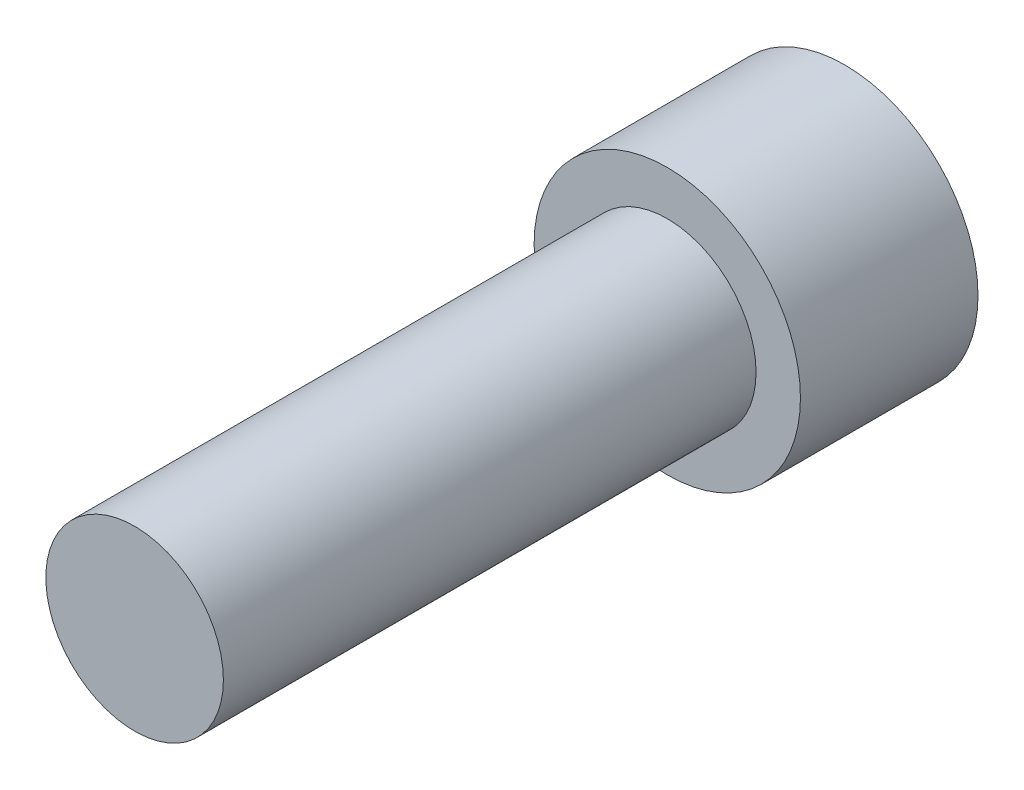
ISO-10303-21;
HEADER;
FILE_DESCRIPTION(('STEP AP214'),'2;1');
FILE_NAME('part.step','',(''),(''),'','','');
FILE_SCHEMA(('AUTOMOTIVE_DESIGN { 1 0 10303 214 1 1 1 1 }'));
ENDSEC;
DATA;
#1=APPLICATION_CONTEXT('core data for automotive mechanical design processes');
#2=APPLICATION_PROTOCOL_DEFINITION('international standard','automotive_design',2000,#1);
#3=PRODUCT_CONTEXT('',#1,'mechanical');
#4=PRODUCT('Part','Part','',(#3));
#5=PRODUCT_RELATED_PRODUCT_CATEGORY('part','',(#4));
#6=PRODUCT_DEFINITION_FORMATION('','',#4);
#7=PRODUCT_DEFINITION_CONTEXT('part definition',#1,'design');
#8=PRODUCT_DEFINITION('design','',#6,#7);
#9=PRODUCT_DEFINITION_SHAPE('','',#8);
#10=(LENGTH_UNIT() NAMED_UNIT(*) SI_UNIT(.MILLI.,.METRE.));
#11=(NAMED_UNIT(*) PLANE_ANGLE_UNIT() SI_UNIT($,.RADIAN.));
#12=(NAMED_UNIT(*) SI_UNIT($,.STERADIAN.) SOLID_ANGLE_UNIT());
#13=UNCERTAINTY_MEASURE_WITH_UNIT(LENGTH_MEASURE(1.E-05),#10,'distance_accuracy_value','');
#14=(GEOMETRIC_REPRESENTATION_CONTEXT(3) GLOBAL_UNCERTAINTY_ASSIGNED_CONTEXT((#13)) GLOBAL_UNIT_ASSIGNED_CONTEXT((#10,
#11,#12)) REPRESENTATION_CONTEXT('',''));
#15=CARTESIAN_POINT('',(0.,0.,0.));
#16=DIRECTION('',(0.,0.,1.));
#17=DIRECTION('',(1.,0.,0.));
#18=AXIS2_PLACEMENT_3D('',#15,#16,#17);
#19=CARTESIAN_POINT('',(0.,0.,1.));
#20=DIRECTION('',(0.,0.,1.));
#21=DIRECTION('',(1.,0.,0.));
#22=AXIS2_PLACEMENT_3D('',#19,#20,#21);
#23=PLANE('',#22);
#24=CARTESIAN_POINT('',(0.,0.,1.));
#25=DIRECTION('',(0.,0.,1.));
#26=DIRECTION('',(1.,0.,0.));
#27=AXIS2_PLACEMENT_3D('',#24,#25,#26);
#28=CIRCLE('',#27,0.750000000000001);
#29=CARTESIAN_POINT('',(0.750000000000001,0.,1.));
#30=VERTEX_POINT('',#29);
#31=EDGE_CURVE('E11',#30,#30,#28,.T.);
#32=ORIENTED_EDGE('',*,*,#31,.T.);
#33=EDGE_LOOP('',(#32));
#34=FACE_BOUND('',#33,.T.);
#35=CARTESIAN_POINT('',(0.,0.,1.));
#36=DIRECTION('',(0.,0.,1.));
#37=DIRECTION('',(1.,0.,0.));
#38=AXIS2_PLACEMENT_3D('',#35,#36,#37);
#39=CIRCLE('',#38,0.5);
#40=CARTESIAN_POINT('',(0.5,0.,1.));
#41=VERTEX_POINT('',#40);
#42=EDGE_CURVE('E134',#41,#41,#39,.T.);
#43=ORIENTED_EDGE('',*,*,#42,.F.);
#44=EDGE_LOOP('',(#43));
#45=FACE_BOUND('',#44,.T.);
#46=ADVANCED_FACE('F32',(#34,#45),#23,.T.);
#47=CARTESIAN_POINT('',(0.,0.,1.));
#48=DIRECTION('',(0.,0.,-1.));
#49=DIRECTION('',(-1.,0.,0.));
#50=AXIS2_PLACEMENT_3D('',#47,#48,#49);
#51=CYLINDRICAL_SURFACE('',#50,0.750000000000001);
#52=ORIENTED_EDGE('',*,*,#31,.F.);
#53=EDGE_LOOP('',(#52));
#54=FACE_BOUND('',#53,.T.);
#55=CARTESIAN_POINT('',(0.,0.,0.));
#56=DIRECTION('',(0.,0.,1.));
#57=DIRECTION('',(1.,0.,0.));
#58=AXIS2_PLACEMENT_3D('',#55,#56,#57);
#59=CIRCLE('',#58,0.750000000000001);
#60=CARTESIAN_POINT('',(0.750000000000001,0.,0.));
#61=VERTEX_POINT('',#60);
#62=EDGE_CURVE('E36',#61,#61,#59,.T.);
#63=ORIENTED_EDGE('',*,*,#62,.T.);
#64=EDGE_LOOP('',(#63));
#65=FACE_BOUND('',#64,.T.);
#66=ADVANCED_FACE('F34',(#54,#65),#51,.T.);
#67=CARTESIAN_POINT('',(0.,0.,0.));
#68=DIRECTION('',(0.,0.,1.));
#69=DIRECTION('',(1.,0.,0.));
#70=AXIS2_PLACEMENT_3D('',#67,#68,#69);
#71=PLANE('',#70);
#72=DIRECTION('',(0.5,0.866025403784439,0.));
#73=VECTOR('',#72,1.);
#74=CARTESIAN_POINT('',(-0.577350269189626,0.,0.));
#75=LINE('',#74,#73);
#76=CARTESIAN_POINT('',(-0.577350269189626,0.,0.));
#77=VERTEX_POINT('',#76);
#78=CARTESIAN_POINT('',(-0.288675134594813,0.5,0.));
#79=VERTEX_POINT('',#78);
#80=EDGE_CURVE('E121',#77,#79,#75,.T.);
#81=ORIENTED_EDGE('',*,*,#80,.F.);
#82=DIRECTION('',(-0.5,0.866025403784439,0.));
#83=VECTOR('',#82,1.);
#84=CARTESIAN_POINT('',(-0.288675134594813,-0.5,0.));
#85=LINE('',#84,#83);
#86=CARTESIAN_POINT('',(-0.288675134594813,-0.5,0.));
#87=VERTEX_POINT('',#86);
#88=EDGE_CURVE('E47',#87,#77,#85,.T.);
#89=ORIENTED_EDGE('',*,*,#88,.F.);
#90=DIRECTION('',(-1.,0.,0.));
#91=VECTOR('',#90,1.);
#92=CARTESIAN_POINT('',(0.288675134594813,-0.5,0.));
#93=LINE('',#92,#91);
#94=CARTESIAN_POINT('',(0.288675134594813,-0.5,0.));
#95=VERTEX_POINT('',#94);
#96=EDGE_CURVE('E130',#95,#87,#93,.T.);
#97=ORIENTED_EDGE('',*,*,#96,.F.);
#98=DIRECTION('',(-0.5,-0.866025403784439,0.));
#99=VECTOR('',#98,1.);
#100=CARTESIAN_POINT('',(0.577350269189626,0.,0.));
#101=LINE('',#100,#99);
#102=CARTESIAN_POINT('',(0.577350269189626,0.,0.));
#103=VERTEX_POINT('',#102);
#104=EDGE_CURVE('E128',#103,#95,#101,.T.);
#105=ORIENTED_EDGE('',*,*,#104,.F.);
#106=DIRECTION('',(0.5,-0.866025403784439,0.));
#107=VECTOR('',#106,1.);
#108=CARTESIAN_POINT('',(0.288675134594813,0.5,0.));
#109=LINE('',#108,#107);
#110=CARTESIAN_POINT('',(0.288675134594813,0.5,0.));
#111=VERTEX_POINT('',#110);
#112=EDGE_CURVE('E95',#111,#103,#109,.T.);
#113=ORIENTED_EDGE('',*,*,#112,.F.);
#114=DIRECTION('',(1.,0.,0.));
#115=VECTOR('',#114,1.);
#116=CARTESIAN_POINT('',(-0.288675134594813,0.5,0.));
#117=LINE('',#116,#115);
#118=EDGE_CURVE('E124',#79,#111,#117,.T.);
#119=ORIENTED_EDGE('',*,*,#118,.F.);
#120=EDGE_LOOP('',(#81,#89,#97,#105,#113,#119));
#121=FACE_BOUND('',#120,.T.);
#122=ORIENTED_EDGE('',*,*,#62,.F.);
#123=EDGE_LOOP('',(#122));
#124=FACE_BOUND('',#123,.T.);
#125=ADVANCED_FACE('F154',(#121,#124),#71,.F.);
#126=CARTESIAN_POINT('',(0.,0.,4.));
#127=DIRECTION('',(0.,0.,-1.));
#128=DIRECTION('',(-1.,0.,0.));
#129=AXIS2_PLACEMENT_3D('',#126,#127,#128);
#130=CYLINDRICAL_SURFACE('',#129,0.5);
#131=CARTESIAN_POINT('',(0.,0.,4.));
#132=DIRECTION('',(0.,0.,1.));
#133=DIRECTION('',(1.,0.,0.));
#134=AXIS2_PLACEMENT_3D('',#131,#132,#133);
#135=CIRCLE('',#134,0.5);
#136=CARTESIAN_POINT('',(0.5,0.,4.));
#137=VERTEX_POINT('',#136);
#138=EDGE_CURVE('E140',#137,#137,#135,.T.);
#139=ORIENTED_EDGE('',*,*,#138,.F.);
#140=EDGE_LOOP('',(#139));
#141=FACE_BOUND('',#140,.T.);
#142=ORIENTED_EDGE('',*,*,#42,.T.);
#143=EDGE_LOOP('',(#142));
#144=FACE_BOUND('',#143,.T.);
#145=ADVANCED_FACE('F146',(#141,#144),#130,.T.);
#146=CARTESIAN_POINT('',(0.,0.,4.));
#147=DIRECTION('',(0.,0.,1.));
#148=DIRECTION('',(1.,0.,0.));
#149=AXIS2_PLACEMENT_3D('',#146,#147,#148);
#150=PLANE('',#149);
#151=ORIENTED_EDGE('',*,*,#138,.T.);
#152=EDGE_LOOP('',(#151));
#153=FACE_BOUND('',#152,.T.);
#154=ADVANCED_FACE('F163',(#153),#150,.T.);
#155=CARTESIAN_POINT('',(-0.288675134594813,-0.5,0.75));
#156=DIRECTION('',(-0.866025403784439,-0.5,0.));
#157=DIRECTION('',(0.5,-0.866025403784439,0.));
#158=AXIS2_PLACEMENT_3D('',#155,#156,#157);
#159=PLANE('',#158);
#160=ORIENTED_EDGE('',*,*,#88,.T.);
#161=DIRECTION('',(0.,0.,-1.));
#162=VECTOR('',#161,1.);
#163=CARTESIAN_POINT('',(-0.577350269189626,0.,0.75));
#164=LINE('',#163,#162);
#165=CARTESIAN_POINT('',(-0.577350269189626,0.,0.75));
#166=VERTEX_POINT('',#165);
#167=EDGE_CURVE('E77',#166,#77,#164,.T.);
#168=ORIENTED_EDGE('',*,*,#167,.F.);
#169=DIRECTION('',(-0.5,0.866025403784439,0.));
#170=VECTOR('',#169,1.);
#171=CARTESIAN_POINT('',(-0.288675134594813,-0.5,0.75));
#172=LINE('',#171,#170);
#173=CARTESIAN_POINT('',(-0.288675134594813,-0.5,0.75));
#174=VERTEX_POINT('',#173);
#175=EDGE_CURVE('E132',#174,#166,#172,.T.);
#176=ORIENTED_EDGE('',*,*,#175,.F.);
#177=DIRECTION('',(0.,0.,-1.));
#178=VECTOR('',#177,1.);
#179=CARTESIAN_POINT('',(-0.288675134594813,-0.5,0.75));
#180=LINE('',#179,#178);
#181=EDGE_CURVE('E55',#174,#87,#180,.T.);
#182=ORIENTED_EDGE('',*,*,#181,.T.);
#183=EDGE_LOOP('',(#160,#168,#176,#182));
#184=FACE_BOUND('',#183,.T.);
#185=ADVANCED_FACE('F175',(#184),#159,.F.);
#186=CARTESIAN_POINT('',(0.288675134594813,-0.5,0.75));
#187=DIRECTION('',(0.,-1.,0.));
#188=DIRECTION('',(1.,0.,0.));
#189=AXIS2_PLACEMENT_3D('',#186,#187,#188);
#190=PLANE('',#189);
#191=ORIENTED_EDGE('',*,*,#96,.T.);
#192=ORIENTED_EDGE('',*,*,#181,.F.);
#193=DIRECTION('',(-1.,0.,0.));
#194=VECTOR('',#193,1.);
#195=CARTESIAN_POINT('',(0.288675134594813,-0.5,0.75));
#196=LINE('',#195,#194);
#197=CARTESIAN_POINT('',(0.288675134594813,-0.5,0.75));
#198=VERTEX_POINT('',#197);
#199=EDGE_CURVE('E107',#198,#174,#196,.T.);
#200=ORIENTED_EDGE('',*,*,#199,.F.);
#201=DIRECTION('',(0.,0.,-1.));
#202=VECTOR('',#201,1.);
#203=CARTESIAN_POINT('',(0.288675134594813,-0.5,0.75));
#204=LINE('',#203,#202);
#205=EDGE_CURVE('E99',#198,#95,#204,.T.);
#206=ORIENTED_EDGE('',*,*,#205,.T.);
#207=EDGE_LOOP('',(#191,#192,#200,#206));
#208=FACE_BOUND('',#207,.T.);
#209=ADVANCED_FACE('F177',(#208),#190,.F.);
#210=CARTESIAN_POINT('',(0.577350269189626,0.,0.75));
#211=DIRECTION('',(0.866025403784439,-0.5,0.));
#212=DIRECTION('',(0.5,0.866025403784439,0.));
#213=AXIS2_PLACEMENT_3D('',#210,#211,#212);
#214=PLANE('',#213);
#215=ORIENTED_EDGE('',*,*,#104,.T.);
#216=ORIENTED_EDGE('',*,*,#205,.F.);
#217=DIRECTION('',(-0.5,-0.866025403784439,0.));
#218=VECTOR('',#217,1.);
#219=CARTESIAN_POINT('',(0.577350269189626,0.,0.75));
#220=LINE('',#219,#218);
#221=CARTESIAN_POINT('',(0.577350269189626,0.,0.75));
#222=VERTEX_POINT('',#221);
#223=EDGE_CURVE('E103',#222,#198,#220,.T.);
#224=ORIENTED_EDGE('',*,*,#223,.F.);
#225=DIRECTION('',(0.,0.,-1.));
#226=VECTOR('',#225,1.);
#227=CARTESIAN_POINT('',(0.577350269189626,0.,0.75));
#228=LINE('',#227,#226);
#229=EDGE_CURVE('E88',#222,#103,#228,.T.);
#230=ORIENTED_EDGE('',*,*,#229,.T.);
#231=EDGE_LOOP('',(#215,#216,#224,#230));
#232=FACE_BOUND('',#231,.T.);
#233=ADVANCED_FACE('F104',(#232),#214,.F.);
#234=CARTESIAN_POINT('',(0.288675134594813,0.5,0.75));
#235=DIRECTION('',(0.866025403784439,0.5,0.));
#236=DIRECTION('',(-0.5,0.866025403784439,0.));
#237=AXIS2_PLACEMENT_3D('',#234,#235,#236);
#238=PLANE('',#237);
#239=ORIENTED_EDGE('',*,*,#112,.T.);
#240=ORIENTED_EDGE('',*,*,#229,.F.);
#241=DIRECTION('',(0.5,-0.866025403784439,0.));
#242=VECTOR('',#241,1.);
#243=CARTESIAN_POINT('',(0.288675134594813,0.5,0.75));
#244=LINE('',#243,#242);
#245=CARTESIAN_POINT('',(0.288675134594813,0.5,0.75));
#246=VERTEX_POINT('',#245);
#247=EDGE_CURVE('E92',#246,#222,#244,.T.);
#248=ORIENTED_EDGE('',*,*,#247,.F.);
#249=DIRECTION('',(0.,0.,-1.));
#250=VECTOR('',#249,1.);
#251=CARTESIAN_POINT('',(0.288675134594813,0.5,0.75));
#252=LINE('',#251,#250);
#253=EDGE_CURVE('E100',#246,#111,#252,.T.);
#254=ORIENTED_EDGE('',*,*,#253,.T.);
#255=EDGE_LOOP('',(#239,#240,#248,#254));
#256=FACE_BOUND('',#255,.T.);
#257=ADVANCED_FACE('F90',(#256),#238,.F.);
#258=CARTESIAN_POINT('',(-0.288675134594813,0.5,0.75));
#259=DIRECTION('',(0.,1.,0.));
#260=DIRECTION('',(0.,0.,1.));
#261=AXIS2_PLACEMENT_3D('',#258,#259,#260);
#262=PLANE('',#261);
#263=ORIENTED_EDGE('',*,*,#118,.T.);
#264=ORIENTED_EDGE('',*,*,#253,.F.);
#265=DIRECTION('',(1.,0.,0.));
#266=VECTOR('',#265,1.);
#267=CARTESIAN_POINT('',(-0.288675134594813,0.5,0.75));
#268=LINE('',#267,#266);
#269=CARTESIAN_POINT('',(-0.288675134594813,0.5,0.75));
#270=VERTEX_POINT('',#269);
#271=EDGE_CURVE('E113',#270,#246,#268,.T.);
#272=ORIENTED_EDGE('',*,*,#271,.F.);
#273=DIRECTION('',(0.,0.,-1.));
#274=VECTOR('',#273,1.);
#275=CARTESIAN_POINT('',(-0.288675134594813,0.5,0.75));
#276=LINE('',#275,#274);
#277=EDGE_CURVE('E137',#270,#79,#276,.T.);
#278=ORIENTED_EDGE('',*,*,#277,.T.);
#279=EDGE_LOOP('',(#263,#264,#272,#278));
#280=FACE_BOUND('',#279,.T.);
#281=ADVANCED_FACE('F188',(#280),#262,.F.);
#282=CARTESIAN_POINT('',(-0.577350269189626,0.,0.75));
#283=DIRECTION('',(-0.866025403784439,0.5,0.));
#284=DIRECTION('',(-0.5,-0.866025403784439,0.));
#285=AXIS2_PLACEMENT_3D('',#282,#283,#284);
#286=PLANE('',#285);
#287=ORIENTED_EDGE('',*,*,#80,.T.);
#288=ORIENTED_EDGE('',*,*,#277,.F.);
#289=DIRECTION('',(0.5,0.866025403784439,0.));
#290=VECTOR('',#289,1.);
#291=CARTESIAN_POINT('',(-0.577350269189626,0.,0.75));
#292=LINE('',#291,#290);
#293=EDGE_CURVE('E115',#166,#270,#292,.T.);
#294=ORIENTED_EDGE('',*,*,#293,.F.);
#295=ORIENTED_EDGE('',*,*,#167,.T.);
#296=EDGE_LOOP('',(#287,#288,#294,#295));
#297=FACE_BOUND('',#296,.T.);
#298=ADVANCED_FACE('F173',(#297),#286,.F.);
#299=CARTESIAN_POINT('',(0.,0.,0.75));
#300=DIRECTION('',(0.,0.,-1.));
#301=DIRECTION('',(-1.,0.,0.));
#302=AXIS2_PLACEMENT_3D('',#299,#300,#301);
#303=PLANE('',#302);
#304=ORIENTED_EDGE('',*,*,#175,.T.);
#305=ORIENTED_EDGE('',*,*,#293,.T.);
#306=ORIENTED_EDGE('',*,*,#271,.T.);
#307=ORIENTED_EDGE('',*,*,#247,.T.);
#308=ORIENTED_EDGE('',*,*,#223,.T.);
#309=ORIENTED_EDGE('',*,*,#199,.T.);
#310=EDGE_LOOP('',(#304,#305,#306,#307,#308,#309));
#311=FACE_BOUND('',#310,.T.);
#312=ADVANCED_FACE('F110',(#311),#303,.T.);
#313=CLOSED_SHELL('',(#46,#66,#125,#145,#154,#185,#209,#233,#257,#281,#298,#312));
#314=MANIFOLD_SOLID_BREP('B2',#313);
#315=ADVANCED_BREP_SHAPE_REPRESENTATION('',(#18,#314),#14);
#316=SHAPE_DEFINITION_REPRESENTATION(#9,#315);
ENDSEC;
END-ISO-10303-21;
